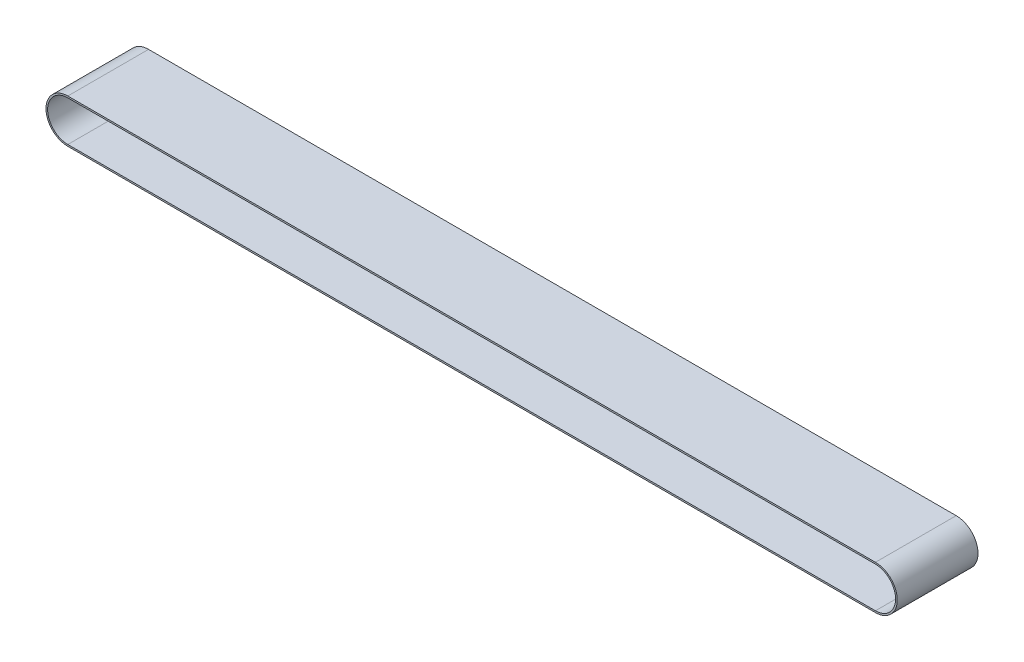
ISO-10303-21;
HEADER;
FILE_DESCRIPTION(('STEP AP214'),'2;1');
FILE_NAME('part.step','',(''),(''),'','','');
FILE_SCHEMA(('AUTOMOTIVE_DESIGN { 1 0 10303 214 1 1 1 1 }'));
ENDSEC;
DATA;
#1=APPLICATION_CONTEXT('core data for automotive mechanical design processes');
#2=APPLICATION_PROTOCOL_DEFINITION('international standard','automotive_design',2000,#1);
#3=PRODUCT_CONTEXT('',#1,'mechanical');
#4=PRODUCT('Part','Part','',(#3));
#5=PRODUCT_RELATED_PRODUCT_CATEGORY('part','',(#4));
#6=PRODUCT_DEFINITION_FORMATION('','',#4);
#7=PRODUCT_DEFINITION_CONTEXT('part definition',#1,'design');
#8=PRODUCT_DEFINITION('design','',#6,#7);
#9=PRODUCT_DEFINITION_SHAPE('','',#8);
#10=(LENGTH_UNIT() NAMED_UNIT(*) SI_UNIT(.MILLI.,.METRE.));
#11=(NAMED_UNIT(*) PLANE_ANGLE_UNIT() SI_UNIT($,.RADIAN.));
#12=(NAMED_UNIT(*) SI_UNIT($,.STERADIAN.) SOLID_ANGLE_UNIT());
#13=UNCERTAINTY_MEASURE_WITH_UNIT(LENGTH_MEASURE(1.E-05),#10,'distance_accuracy_value','');
#14=(GEOMETRIC_REPRESENTATION_CONTEXT(3) GLOBAL_UNCERTAINTY_ASSIGNED_CONTEXT((#13)) GLOBAL_UNIT_ASSIGNED_CONTEXT((#10,
#11,#12)) REPRESENTATION_CONTEXT('',''));
#15=CARTESIAN_POINT('',(0.,0.,0.));
#16=DIRECTION('',(0.,0.,1.));
#17=DIRECTION('',(1.,0.,0.));
#18=AXIS2_PLACEMENT_3D('',#15,#16,#17);
#19=CARTESIAN_POINT('',(-500.,0.,100.));
#20=DIRECTION('',(0.,0.,1.));
#21=DIRECTION('',(1.,0.,0.));
#22=AXIS2_PLACEMENT_3D('',#19,#20,#21);
#23=PLANE('',#22);
#24=CARTESIAN_POINT('',(-500.,0.,100.));
#25=DIRECTION('',(0.,0.,1.));
#26=DIRECTION('',(1.,0.,0.));
#27=AXIS2_PLACEMENT_3D('',#24,#25,#26);
#28=CIRCLE('',#27,27.);
#29=CARTESIAN_POINT('',(-500.,27.,100.));
#30=VERTEX_POINT('',#29);
#31=CARTESIAN_POINT('',(-500.,-27.,100.));
#32=VERTEX_POINT('',#31);
#33=EDGE_CURVE('E177',#30,#32,#28,.T.);
#34=ORIENTED_EDGE('',*,*,#33,.T.);
#35=DIRECTION('',(1.,0.,0.));
#36=VECTOR('',#35,1.);
#37=CARTESIAN_POINT('',(-500.,-27.,100.));
#38=LINE('',#37,#36);
#39=CARTESIAN_POINT('',(500.,-26.9999999999999,100.));
#40=VERTEX_POINT('',#39);
#41=EDGE_CURVE('E181',#32,#40,#38,.T.);
#42=ORIENTED_EDGE('',*,*,#41,.T.);
#43=CARTESIAN_POINT('',(500.,1.11022302462516E-13,100.));
#44=DIRECTION('',(0.,0.,1.));
#45=DIRECTION('',(1.,0.,0.));
#46=AXIS2_PLACEMENT_3D('',#43,#44,#45);
#47=CIRCLE('',#46,27.);
#48=CARTESIAN_POINT('',(500.,27.0000000000001,100.));
#49=VERTEX_POINT('',#48);
#50=EDGE_CURVE('E185',#40,#49,#47,.T.);
#51=ORIENTED_EDGE('',*,*,#50,.T.);
#52=DIRECTION('',(-1.,0.,0.));
#53=VECTOR('',#52,1.);
#54=CARTESIAN_POINT('',(-500.,27.,100.));
#55=LINE('',#54,#53);
#56=EDGE_CURVE('E188',#49,#30,#55,.T.);
#57=ORIENTED_EDGE('',*,*,#56,.T.);
#58=EDGE_LOOP('',(#34,#42,#51,#57));
#59=FACE_BOUND('',#58,.T.);
#60=DIRECTION('',(1.,0.,0.));
#61=VECTOR('',#60,1.);
#62=CARTESIAN_POINT('',(-500.,-25.,100.));
#63=LINE('',#62,#61);
#64=CARTESIAN_POINT('',(-500.,-25.,100.));
#65=VERTEX_POINT('',#64);
#66=CARTESIAN_POINT('',(500.,-24.9999999999999,100.));
#67=VERTEX_POINT('',#66);
#68=EDGE_CURVE('E138',#65,#67,#63,.T.);
#69=ORIENTED_EDGE('',*,*,#68,.F.);
#70=CARTESIAN_POINT('',(-500.,0.,100.));
#71=DIRECTION('',(0.,0.,1.));
#72=DIRECTION('',(1.,0.,0.));
#73=AXIS2_PLACEMENT_3D('',#70,#71,#72);
#74=CIRCLE('',#73,25.);
#75=CARTESIAN_POINT('',(-500.,25.,100.));
#76=VERTEX_POINT('',#75);
#77=EDGE_CURVE('E129',#76,#65,#74,.T.);
#78=ORIENTED_EDGE('',*,*,#77,.F.);
#79=DIRECTION('',(-1.,0.,0.));
#80=VECTOR('',#79,1.);
#81=CARTESIAN_POINT('',(-500.,25.,100.));
#82=LINE('',#81,#80);
#83=CARTESIAN_POINT('',(500.,25.0000000000001,100.));
#84=VERTEX_POINT('',#83);
#85=EDGE_CURVE('E155',#84,#76,#82,.T.);
#86=ORIENTED_EDGE('',*,*,#85,.F.);
#87=CARTESIAN_POINT('',(500.,1.11022302462516E-13,100.));
#88=DIRECTION('',(0.,0.,1.));
#89=DIRECTION('',(-1.,0.,0.));
#90=AXIS2_PLACEMENT_3D('',#87,#88,#89);
#91=CIRCLE('',#90,25.);
#92=EDGE_CURVE('E151',#67,#84,#91,.T.);
#93=ORIENTED_EDGE('',*,*,#92,.F.);
#94=EDGE_LOOP('',(#69,#78,#86,#93));
#95=FACE_BOUND('',#94,.T.);
#96=ADVANCED_FACE('F63',(#59,#95),#23,.T.);
#97=CARTESIAN_POINT('',(-500.,0.,0.));
#98=DIRECTION('',(0.,0.,1.));
#99=DIRECTION('',(1.,0.,0.));
#100=AXIS2_PLACEMENT_3D('',#97,#98,#99);
#101=PLANE('',#100);
#102=CARTESIAN_POINT('',(-500.,0.,0.));
#103=DIRECTION('',(0.,0.,1.));
#104=DIRECTION('',(1.,0.,0.));
#105=AXIS2_PLACEMENT_3D('',#102,#103,#104);
#106=CIRCLE('',#105,27.);
#107=CARTESIAN_POINT('',(-500.,27.,0.));
#108=VERTEX_POINT('',#107);
#109=CARTESIAN_POINT('',(-500.,-27.,0.));
#110=VERTEX_POINT('',#109);
#111=EDGE_CURVE('E147',#108,#110,#106,.T.);
#112=ORIENTED_EDGE('',*,*,#111,.F.);
#113=DIRECTION('',(-1.,0.,0.));
#114=VECTOR('',#113,1.);
#115=CARTESIAN_POINT('',(-500.,27.,0.));
#116=LINE('',#115,#114);
#117=CARTESIAN_POINT('',(500.,27.0000000000001,0.));
#118=VERTEX_POINT('',#117);
#119=EDGE_CURVE('E182',#118,#108,#116,.T.);
#120=ORIENTED_EDGE('',*,*,#119,.F.);
#121=CARTESIAN_POINT('',(500.,1.11022302462516E-13,0.));
#122=DIRECTION('',(0.,0.,1.));
#123=DIRECTION('',(1.,0.,0.));
#124=AXIS2_PLACEMENT_3D('',#121,#122,#123);
#125=CIRCLE('',#124,27.);
#126=CARTESIAN_POINT('',(500.,-26.9999999999999,0.));
#127=VERTEX_POINT('',#126);
#128=EDGE_CURVE('E198',#127,#118,#125,.T.);
#129=ORIENTED_EDGE('',*,*,#128,.F.);
#130=DIRECTION('',(1.,0.,0.));
#131=VECTOR('',#130,1.);
#132=CARTESIAN_POINT('',(-500.,-27.,0.));
#133=LINE('',#132,#131);
#134=EDGE_CURVE('E195',#110,#127,#133,.T.);
#135=ORIENTED_EDGE('',*,*,#134,.F.);
#136=EDGE_LOOP('',(#112,#120,#129,#135));
#137=FACE_BOUND('',#136,.T.);
#138=CARTESIAN_POINT('',(-500.,0.,0.));
#139=DIRECTION('',(0.,0.,1.));
#140=DIRECTION('',(1.,0.,0.));
#141=AXIS2_PLACEMENT_3D('',#138,#139,#140);
#142=CIRCLE('',#141,25.);
#143=CARTESIAN_POINT('',(-500.,25.,0.));
#144=VERTEX_POINT('',#143);
#145=CARTESIAN_POINT('',(-500.,-25.,0.));
#146=VERTEX_POINT('',#145);
#147=EDGE_CURVE('E87',#144,#146,#142,.T.);
#148=ORIENTED_EDGE('',*,*,#147,.T.);
#149=DIRECTION('',(1.,0.,0.));
#150=VECTOR('',#149,1.);
#151=CARTESIAN_POINT('',(-500.,-25.,0.));
#152=LINE('',#151,#150);
#153=CARTESIAN_POINT('',(500.,-24.9999999999999,0.));
#154=VERTEX_POINT('',#153);
#155=EDGE_CURVE('E145',#146,#154,#152,.T.);
#156=ORIENTED_EDGE('',*,*,#155,.T.);
#157=CARTESIAN_POINT('',(500.,1.11022302462516E-13,0.));
#158=DIRECTION('',(0.,0.,1.));
#159=DIRECTION('',(-1.,0.,0.));
#160=AXIS2_PLACEMENT_3D('',#157,#158,#159);
#161=CIRCLE('',#160,25.);
#162=CARTESIAN_POINT('',(500.,25.0000000000001,0.));
#163=VERTEX_POINT('',#162);
#164=EDGE_CURVE('E164',#154,#163,#161,.T.);
#165=ORIENTED_EDGE('',*,*,#164,.T.);
#166=DIRECTION('',(-1.,0.,0.));
#167=VECTOR('',#166,1.);
#168=CARTESIAN_POINT('',(-500.,25.,0.));
#169=LINE('',#168,#167);
#170=EDGE_CURVE('E139',#163,#144,#169,.T.);
#171=ORIENTED_EDGE('',*,*,#170,.T.);
#172=EDGE_LOOP('',(#148,#156,#165,#171));
#173=FACE_BOUND('',#172,.T.);
#174=ADVANCED_FACE('F221',(#137,#173),#101,.F.);
#175=CARTESIAN_POINT('',(-500.,0.,100.));
#176=DIRECTION('',(0.,0.,-1.));
#177=DIRECTION('',(-1.,0.,0.));
#178=AXIS2_PLACEMENT_3D('',#175,#176,#177);
#179=CYLINDRICAL_SURFACE('',#178,27.);
#180=ORIENTED_EDGE('',*,*,#111,.T.);
#181=DIRECTION('',(0.,0.,-1.));
#182=VECTOR('',#181,1.);
#183=CARTESIAN_POINT('',(-500.,-27.,100.));
#184=LINE('',#183,#182);
#185=EDGE_CURVE('E12',#32,#110,#184,.T.);
#186=ORIENTED_EDGE('',*,*,#185,.F.);
#187=ORIENTED_EDGE('',*,*,#33,.F.);
#188=DIRECTION('',(0.,0.,-1.));
#189=VECTOR('',#188,1.);
#190=CARTESIAN_POINT('',(-500.,27.,100.));
#191=LINE('',#190,#189);
#192=EDGE_CURVE('E191',#30,#108,#191,.T.);
#193=ORIENTED_EDGE('',*,*,#192,.T.);
#194=EDGE_LOOP('',(#180,#186,#187,#193));
#195=FACE_BOUND('',#194,.T.);
#196=ADVANCED_FACE('F65',(#195),#179,.T.);
#197=CARTESIAN_POINT('',(-500.,-27.,100.));
#198=DIRECTION('',(0.,1.,0.));
#199=DIRECTION('',(-1.,0.,0.));
#200=AXIS2_PLACEMENT_3D('',#197,#198,#199);
#201=PLANE('',#200);
#202=ORIENTED_EDGE('',*,*,#134,.T.);
#203=DIRECTION('',(0.,0.,-1.));
#204=VECTOR('',#203,1.);
#205=CARTESIAN_POINT('',(500.,-26.9999999999999,100.));
#206=LINE('',#205,#204);
#207=EDGE_CURVE('E72',#40,#127,#206,.T.);
#208=ORIENTED_EDGE('',*,*,#207,.F.);
#209=ORIENTED_EDGE('',*,*,#41,.F.);
#210=ORIENTED_EDGE('',*,*,#185,.T.);
#211=EDGE_LOOP('',(#202,#208,#209,#210));
#212=FACE_BOUND('',#211,.T.);
#213=ADVANCED_FACE('F231',(#212),#201,.F.);
#214=CARTESIAN_POINT('',(500.,1.11022302462516E-13,100.));
#215=DIRECTION('',(0.,0.,-1.));
#216=DIRECTION('',(-1.,0.,0.));
#217=AXIS2_PLACEMENT_3D('',#214,#215,#216);
#218=CYLINDRICAL_SURFACE('',#217,27.);
#219=ORIENTED_EDGE('',*,*,#128,.T.);
#220=DIRECTION('',(0.,0.,-1.));
#221=VECTOR('',#220,1.);
#222=CARTESIAN_POINT('',(500.,27.0000000000001,100.));
#223=LINE('',#222,#221);
#224=EDGE_CURVE('E206',#49,#118,#223,.T.);
#225=ORIENTED_EDGE('',*,*,#224,.F.);
#226=ORIENTED_EDGE('',*,*,#50,.F.);
#227=ORIENTED_EDGE('',*,*,#207,.T.);
#228=EDGE_LOOP('',(#219,#225,#226,#227));
#229=FACE_BOUND('',#228,.T.);
#230=ADVANCED_FACE('F215',(#229),#218,.T.);
#231=CARTESIAN_POINT('',(-500.,27.,100.));
#232=DIRECTION('',(0.,-1.,0.));
#233=DIRECTION('',(1.,0.,0.));
#234=AXIS2_PLACEMENT_3D('',#231,#232,#233);
#235=PLANE('',#234);
#236=ORIENTED_EDGE('',*,*,#119,.T.);
#237=ORIENTED_EDGE('',*,*,#192,.F.);
#238=ORIENTED_EDGE('',*,*,#56,.F.);
#239=ORIENTED_EDGE('',*,*,#224,.T.);
#240=EDGE_LOOP('',(#236,#237,#238,#239));
#241=FACE_BOUND('',#240,.T.);
#242=ADVANCED_FACE('F225',(#241),#235,.F.);
#243=CARTESIAN_POINT('',(-500.,0.,100.));
#244=DIRECTION('',(0.,0.,-1.));
#245=DIRECTION('',(-1.,0.,0.));
#246=AXIS2_PLACEMENT_3D('',#243,#244,#245);
#247=CYLINDRICAL_SURFACE('',#246,25.);
#248=ORIENTED_EDGE('',*,*,#147,.F.);
#249=DIRECTION('',(0.,0.,-1.));
#250=VECTOR('',#249,1.);
#251=CARTESIAN_POINT('',(-500.,25.,100.));
#252=LINE('',#251,#250);
#253=EDGE_CURVE('E133',#76,#144,#252,.T.);
#254=ORIENTED_EDGE('',*,*,#253,.F.);
#255=ORIENTED_EDGE('',*,*,#77,.T.);
#256=DIRECTION('',(0.,0.,-1.));
#257=VECTOR('',#256,1.);
#258=CARTESIAN_POINT('',(-500.,-25.,100.));
#259=LINE('',#258,#257);
#260=EDGE_CURVE('E132',#65,#146,#259,.T.);
#261=ORIENTED_EDGE('',*,*,#260,.T.);
#262=EDGE_LOOP('',(#248,#254,#255,#261));
#263=FACE_BOUND('',#262,.T.);
#264=ADVANCED_FACE('F131',(#263),#247,.F.);
#265=CARTESIAN_POINT('',(-500.,-25.,100.));
#266=DIRECTION('',(0.,1.,0.));
#267=DIRECTION('',(-1.,0.,0.));
#268=AXIS2_PLACEMENT_3D('',#265,#266,#267);
#269=PLANE('',#268);
#270=ORIENTED_EDGE('',*,*,#155,.F.);
#271=ORIENTED_EDGE('',*,*,#260,.F.);
#272=ORIENTED_EDGE('',*,*,#68,.T.);
#273=DIRECTION('',(0.,0.,-1.));
#274=VECTOR('',#273,1.);
#275=CARTESIAN_POINT('',(500.,-24.9999999999999,100.));
#276=LINE('',#275,#274);
#277=EDGE_CURVE('E148',#67,#154,#276,.T.);
#278=ORIENTED_EDGE('',*,*,#277,.T.);
#279=EDGE_LOOP('',(#270,#271,#272,#278));
#280=FACE_BOUND('',#279,.T.);
#281=ADVANCED_FACE('F142',(#280),#269,.T.);
#282=CARTESIAN_POINT('',(500.,1.11022302462516E-13,100.));
#283=DIRECTION('',(0.,0.,-1.));
#284=DIRECTION('',(-1.,0.,0.));
#285=AXIS2_PLACEMENT_3D('',#282,#283,#284);
#286=CYLINDRICAL_SURFACE('',#285,25.);
#287=ORIENTED_EDGE('',*,*,#164,.F.);
#288=ORIENTED_EDGE('',*,*,#277,.F.);
#289=ORIENTED_EDGE('',*,*,#92,.T.);
#290=DIRECTION('',(0.,0.,-1.));
#291=VECTOR('',#290,1.);
#292=CARTESIAN_POINT('',(500.,25.0000000000001,100.));
#293=LINE('',#292,#291);
#294=EDGE_CURVE('E79',#84,#163,#293,.T.);
#295=ORIENTED_EDGE('',*,*,#294,.T.);
#296=EDGE_LOOP('',(#287,#288,#289,#295));
#297=FACE_BOUND('',#296,.T.);
#298=ADVANCED_FACE('F254',(#297),#286,.F.);
#299=CARTESIAN_POINT('',(-500.,25.,100.));
#300=DIRECTION('',(0.,-1.,0.));
#301=DIRECTION('',(1.,0.,0.));
#302=AXIS2_PLACEMENT_3D('',#299,#300,#301);
#303=PLANE('',#302);
#304=ORIENTED_EDGE('',*,*,#170,.F.);
#305=ORIENTED_EDGE('',*,*,#294,.F.);
#306=ORIENTED_EDGE('',*,*,#85,.T.);
#307=ORIENTED_EDGE('',*,*,#253,.T.);
#308=EDGE_LOOP('',(#304,#305,#306,#307));
#309=FACE_BOUND('',#308,.T.);
#310=ADVANCED_FACE('F258',(#309),#303,.T.);
#311=CLOSED_SHELL('',(#96,#174,#196,#213,#230,#242,#264,#281,#298,#310));
#312=MANIFOLD_SOLID_BREP('B2',#311);
#313=ADVANCED_BREP_SHAPE_REPRESENTATION('',(#18,#312),#14);
#314=SHAPE_DEFINITION_REPRESENTATION(#9,#313);
ENDSEC;
END-ISO-10303-21;
